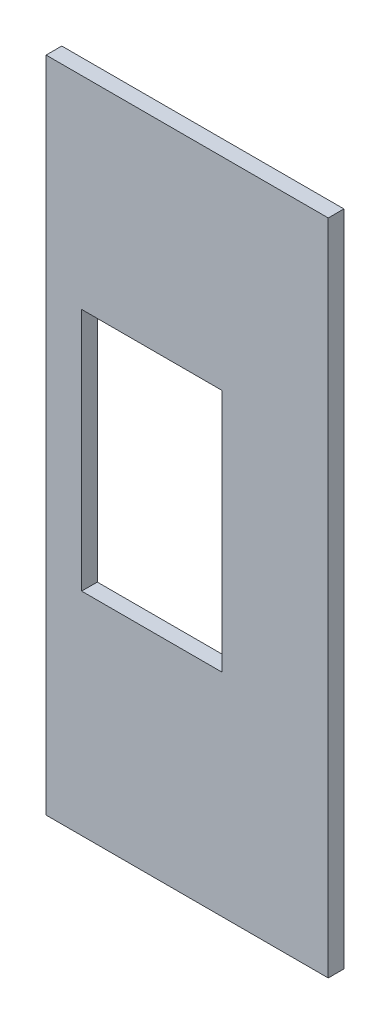
ISO-10303-21;
HEADER;
FILE_DESCRIPTION(('STEP AP214'),'2;1');
FILE_NAME('part.step','',(''),(''),'','','');
FILE_SCHEMA(('AUTOMOTIVE_DESIGN { 1 0 10303 214 1 1 1 1 }'));
ENDSEC;
DATA;
#1=APPLICATION_CONTEXT('core data for automotive mechanical design processes');
#2=APPLICATION_PROTOCOL_DEFINITION('international standard','automotive_design',2000,#1);
#3=PRODUCT_CONTEXT('',#1,'mechanical');
#4=PRODUCT('Part','Part','',(#3));
#5=PRODUCT_RELATED_PRODUCT_CATEGORY('part','',(#4));
#6=PRODUCT_DEFINITION_FORMATION('','',#4);
#7=PRODUCT_DEFINITION_CONTEXT('part definition',#1,'design');
#8=PRODUCT_DEFINITION('design','',#6,#7);
#9=PRODUCT_DEFINITION_SHAPE('','',#8);
#10=(LENGTH_UNIT() NAMED_UNIT(*) SI_UNIT(.MILLI.,.METRE.));
#11=(NAMED_UNIT(*) PLANE_ANGLE_UNIT() SI_UNIT($,.RADIAN.));
#12=(NAMED_UNIT(*) SI_UNIT($,.STERADIAN.) SOLID_ANGLE_UNIT());
#13=UNCERTAINTY_MEASURE_WITH_UNIT(LENGTH_MEASURE(1.E-05),#10,'distance_accuracy_value','');
#14=(GEOMETRIC_REPRESENTATION_CONTEXT(3) GLOBAL_UNCERTAINTY_ASSIGNED_CONTEXT((#13)) GLOBAL_UNIT_ASSIGNED_CONTEXT((#10,
#11,#12)) REPRESENTATION_CONTEXT('',''));
#15=CARTESIAN_POINT('',(0.,0.,0.));
#16=DIRECTION('',(0.,0.,1.));
#17=DIRECTION('',(1.,0.,0.));
#18=AXIS2_PLACEMENT_3D('',#15,#16,#17);
#19=CARTESIAN_POINT('',(188.065936045835,-106.020408950721,283.941063903925));
#20=DIRECTION('',(1.,0.,0.));
#21=DIRECTION('',(0.,1.,0.));
#22=AXIS2_PLACEMENT_3D('',#19,#20,#21);
#23=PLANE('',#22);
#24=DIRECTION('',(0.,-1.,0.));
#25=VECTOR('',#24,1.);
#26=CARTESIAN_POINT('',(188.065936045835,-106.020408950721,283.432971220494));
#27=LINE('',#26,#25);
#28=CARTESIAN_POINT('',(188.065936045835,-106.020408950721,283.432971220494));
#29=VERTEX_POINT('',#28);
#30=CARTESIAN_POINT('',(188.065936045835,-127.373178207628,283.432971220494));
#31=VERTEX_POINT('',#30);
#32=EDGE_CURVE('E124',#29,#31,#27,.T.);
#33=ORIENTED_EDGE('',*,*,#32,.F.);
#34=DIRECTION('',(0.,0.,-1.));
#35=VECTOR('',#34,1.);
#36=CARTESIAN_POINT('',(188.065936045835,-106.020408950721,283.941063903925));
#37=LINE('',#36,#35);
#38=CARTESIAN_POINT('',(188.065936045835,-106.020408950721,283.941063903925));
#39=VERTEX_POINT('',#38);
#40=EDGE_CURVE('E35',#39,#29,#37,.T.);
#41=ORIENTED_EDGE('',*,*,#40,.F.);
#42=DIRECTION('',(0.,-1.,0.));
#43=VECTOR('',#42,1.);
#44=CARTESIAN_POINT('',(188.065936045835,-106.020408950721,283.941063903925));
#45=LINE('',#44,#43);
#46=CARTESIAN_POINT('',(188.065936045835,-127.373178207628,283.941063903925));
#47=VERTEX_POINT('',#46);
#48=EDGE_CURVE('E103',#39,#47,#45,.T.);
#49=ORIENTED_EDGE('',*,*,#48,.T.);
#50=DIRECTION('',(0.,0.,-1.));
#51=VECTOR('',#50,1.);
#52=CARTESIAN_POINT('',(188.065936045835,-127.373178207628,283.941063903925));
#53=LINE('',#52,#51);
#54=EDGE_CURVE('E10',#47,#31,#53,.T.);
#55=ORIENTED_EDGE('',*,*,#54,.T.);
#56=EDGE_LOOP('',(#33,#41,#49,#55));
#57=FACE_BOUND('',#56,.T.);
#58=ADVANCED_FACE('F16',(#57),#23,.T.);
#59=CARTESIAN_POINT('',(188.065936045835,-127.373178207628,283.941063903925));
#60=DIRECTION('',(0.,-1.,0.));
#61=DIRECTION('',(0.,0.,-1.));
#62=AXIS2_PLACEMENT_3D('',#59,#60,#61);
#63=PLANE('',#62);
#64=DIRECTION('',(-1.,0.,0.));
#65=VECTOR('',#64,1.);
#66=CARTESIAN_POINT('',(188.065936045835,-127.373178207628,283.432971220494));
#67=LINE('',#66,#65);
#68=CARTESIAN_POINT('',(178.913166788928,-127.373178207628,283.432971220494));
#69=VERTEX_POINT('',#68);
#70=EDGE_CURVE('E127',#31,#69,#67,.T.);
#71=ORIENTED_EDGE('',*,*,#70,.F.);
#72=ORIENTED_EDGE('',*,*,#54,.F.);
#73=DIRECTION('',(-1.,0.,0.));
#74=VECTOR('',#73,1.);
#75=CARTESIAN_POINT('',(188.065936045835,-127.373178207628,283.941063903925));
#76=LINE('',#75,#74);
#77=CARTESIAN_POINT('',(178.913166788928,-127.373178207628,283.941063903925));
#78=VERTEX_POINT('',#77);
#79=EDGE_CURVE('E99',#47,#78,#76,.T.);
#80=ORIENTED_EDGE('',*,*,#79,.T.);
#81=DIRECTION('',(0.,0.,-1.));
#82=VECTOR('',#81,1.);
#83=CARTESIAN_POINT('',(178.913166788928,-127.373178207628,283.941063903925));
#84=LINE('',#83,#82);
#85=EDGE_CURVE('E26',#78,#69,#84,.T.);
#86=ORIENTED_EDGE('',*,*,#85,.T.);
#87=EDGE_LOOP('',(#71,#72,#80,#86));
#88=FACE_BOUND('',#87,.T.);
#89=ADVANCED_FACE('F100',(#88),#63,.T.);
#90=CARTESIAN_POINT('',(178.913166788928,-127.373178207628,283.941063903925));
#91=DIRECTION('',(-1.,0.,0.));
#92=DIRECTION('',(0.,0.,1.));
#93=AXIS2_PLACEMENT_3D('',#90,#91,#92);
#94=PLANE('',#93);
#95=DIRECTION('',(0.,1.,0.));
#96=VECTOR('',#95,1.);
#97=CARTESIAN_POINT('',(178.913166788928,-127.373178207628,283.432971220494));
#98=LINE('',#97,#96);
#99=CARTESIAN_POINT('',(178.913166788928,-106.020408950721,283.432971220494));
#100=VERTEX_POINT('',#99);
#101=EDGE_CURVE('E93',#69,#100,#98,.T.);
#102=ORIENTED_EDGE('',*,*,#101,.F.);
#103=ORIENTED_EDGE('',*,*,#85,.F.);
#104=DIRECTION('',(0.,1.,0.));
#105=VECTOR('',#104,1.);
#106=CARTESIAN_POINT('',(178.913166788928,-127.373178207628,283.941063903925));
#107=LINE('',#106,#105);
#108=CARTESIAN_POINT('',(178.913166788928,-106.020408950721,283.941063903925));
#109=VERTEX_POINT('',#108);
#110=EDGE_CURVE('E90',#78,#109,#107,.T.);
#111=ORIENTED_EDGE('',*,*,#110,.T.);
#112=DIRECTION('',(0.,0.,-1.));
#113=VECTOR('',#112,1.);
#114=CARTESIAN_POINT('',(178.913166788928,-106.020408950721,283.941063903925));
#115=LINE('',#114,#113);
#116=EDGE_CURVE('E63',#109,#100,#115,.T.);
#117=ORIENTED_EDGE('',*,*,#116,.T.);
#118=EDGE_LOOP('',(#102,#103,#111,#117));
#119=FACE_BOUND('',#118,.T.);
#120=ADVANCED_FACE('F88',(#119),#94,.T.);
#121=CARTESIAN_POINT('',(180.065936045835,-112.589304524067,283.941063903925));
#122=DIRECTION('',(1.,0.,0.));
#123=DIRECTION('',(0.,1.,0.));
#124=AXIS2_PLACEMENT_3D('',#121,#122,#123);
#125=PLANE('',#124);
#126=DIRECTION('',(0.,-1.,0.));
#127=VECTOR('',#126,1.);
#128=CARTESIAN_POINT('',(180.065936045835,-112.589304524067,283.432971220494));
#129=LINE('',#128,#127);
#130=CARTESIAN_POINT('',(180.065936045835,-112.589304524067,283.432971220494));
#131=VERTEX_POINT('',#130);
#132=CARTESIAN_POINT('',(180.065936045835,-120.504282634283,283.432971220494));
#133=VERTEX_POINT('',#132);
#134=EDGE_CURVE('E112',#131,#133,#129,.T.);
#135=ORIENTED_EDGE('',*,*,#134,.F.);
#136=DIRECTION('',(0.,0.,-1.));
#137=VECTOR('',#136,1.);
#138=CARTESIAN_POINT('',(180.065936045835,-112.589304524067,283.941063903925));
#139=LINE('',#138,#137);
#140=CARTESIAN_POINT('',(180.065936045835,-112.589304524067,283.941063903925));
#141=VERTEX_POINT('',#140);
#142=EDGE_CURVE('E108',#141,#131,#139,.T.);
#143=ORIENTED_EDGE('',*,*,#142,.F.);
#144=DIRECTION('',(0.,-1.,0.));
#145=VECTOR('',#144,1.);
#146=CARTESIAN_POINT('',(180.065936045835,-112.589304524067,283.941063903925));
#147=LINE('',#146,#145);
#148=CARTESIAN_POINT('',(180.065936045835,-120.504282634283,283.941063903925));
#149=VERTEX_POINT('',#148);
#150=EDGE_CURVE('E132',#141,#149,#147,.T.);
#151=ORIENTED_EDGE('',*,*,#150,.T.);
#152=DIRECTION('',(0.,0.,-1.));
#153=VECTOR('',#152,1.);
#154=CARTESIAN_POINT('',(180.065936045835,-120.504282634283,283.941063903925));
#155=LINE('',#154,#153);
#156=EDGE_CURVE('E20',#149,#133,#155,.T.);
#157=ORIENTED_EDGE('',*,*,#156,.T.);
#158=EDGE_LOOP('',(#135,#143,#151,#157));
#159=FACE_BOUND('',#158,.T.);
#160=ADVANCED_FACE('F18',(#159),#125,.T.);
#161=CARTESIAN_POINT('',(180.065936045835,-120.504282634283,283.941063903925));
#162=DIRECTION('',(0.,1.,0.));
#163=DIRECTION('',(-1.,0.,0.));
#164=AXIS2_PLACEMENT_3D('',#161,#162,#163);
#165=PLANE('',#164);
#166=DIRECTION('',(1.,0.,0.));
#167=VECTOR('',#166,1.);
#168=CARTESIAN_POINT('',(180.065936045835,-120.504282634283,283.432971220494));
#169=LINE('',#168,#167);
#170=CARTESIAN_POINT('',(184.613166788928,-120.504282634283,283.432971220494));
#171=VERTEX_POINT('',#170);
#172=EDGE_CURVE('E115',#133,#171,#169,.T.);
#173=ORIENTED_EDGE('',*,*,#172,.F.);
#174=ORIENTED_EDGE('',*,*,#156,.F.);
#175=DIRECTION('',(1.,0.,0.));
#176=VECTOR('',#175,1.);
#177=CARTESIAN_POINT('',(180.065936045835,-120.504282634283,283.941063903925));
#178=LINE('',#177,#176);
#179=CARTESIAN_POINT('',(184.613166788928,-120.504282634283,283.941063903925));
#180=VERTEX_POINT('',#179);
#181=EDGE_CURVE('E158',#149,#180,#178,.T.);
#182=ORIENTED_EDGE('',*,*,#181,.T.);
#183=DIRECTION('',(0.,0.,-1.));
#184=VECTOR('',#183,1.);
#185=CARTESIAN_POINT('',(184.613166788928,-120.504282634283,283.941063903925));
#186=LINE('',#185,#184);
#187=EDGE_CURVE('E137',#180,#171,#186,.T.);
#188=ORIENTED_EDGE('',*,*,#187,.T.);
#189=EDGE_LOOP('',(#173,#174,#182,#188));
#190=FACE_BOUND('',#189,.T.);
#191=ADVANCED_FACE('F143',(#190),#165,.T.);
#192=CARTESIAN_POINT('',(184.613166788928,-120.504282634283,283.941063903925));
#193=DIRECTION('',(-1.,0.,0.));
#194=DIRECTION('',(0.,-1.,0.));
#195=AXIS2_PLACEMENT_3D('',#192,#193,#194);
#196=PLANE('',#195);
#197=DIRECTION('',(0.,1.,0.));
#198=VECTOR('',#197,1.);
#199=CARTESIAN_POINT('',(184.613166788928,-120.504282634283,283.432971220494));
#200=LINE('',#199,#198);
#201=CARTESIAN_POINT('',(184.613166788928,-112.589304524067,283.432971220494));
#202=VERTEX_POINT('',#201);
#203=EDGE_CURVE('E118',#171,#202,#200,.T.);
#204=ORIENTED_EDGE('',*,*,#203,.F.);
#205=ORIENTED_EDGE('',*,*,#187,.F.);
#206=DIRECTION('',(0.,1.,0.));
#207=VECTOR('',#206,1.);
#208=CARTESIAN_POINT('',(184.613166788928,-120.504282634283,283.941063903925));
#209=LINE('',#208,#207);
#210=CARTESIAN_POINT('',(184.613166788928,-112.589304524067,283.941063903925));
#211=VERTEX_POINT('',#210);
#212=EDGE_CURVE('E156',#180,#211,#209,.T.);
#213=ORIENTED_EDGE('',*,*,#212,.T.);
#214=DIRECTION('',(0.,0.,-1.));
#215=VECTOR('',#214,1.);
#216=CARTESIAN_POINT('',(184.613166788928,-112.589304524067,283.941063903925));
#217=LINE('',#216,#215);
#218=EDGE_CURVE('E136',#211,#202,#217,.T.);
#219=ORIENTED_EDGE('',*,*,#218,.T.);
#220=EDGE_LOOP('',(#204,#205,#213,#219));
#221=FACE_BOUND('',#220,.T.);
#222=ADVANCED_FACE('F171',(#221),#196,.T.);
#223=CARTESIAN_POINT('',(184.613166788928,-112.589304524067,283.941063903925));
#224=DIRECTION('',(0.,-1.,0.));
#225=DIRECTION('',(1.,0.,0.));
#226=AXIS2_PLACEMENT_3D('',#223,#224,#225);
#227=PLANE('',#226);
#228=DIRECTION('',(-1.,0.,0.));
#229=VECTOR('',#228,1.);
#230=CARTESIAN_POINT('',(184.613166788928,-112.589304524067,283.432971220494));
#231=LINE('',#230,#229);
#232=EDGE_CURVE('E121',#202,#131,#231,.T.);
#233=ORIENTED_EDGE('',*,*,#232,.F.);
#234=ORIENTED_EDGE('',*,*,#218,.F.);
#235=DIRECTION('',(-1.,0.,0.));
#236=VECTOR('',#235,1.);
#237=CARTESIAN_POINT('',(184.613166788928,-112.589304524067,283.941063903925));
#238=LINE('',#237,#236);
#239=EDGE_CURVE('E153',#211,#141,#238,.T.);
#240=ORIENTED_EDGE('',*,*,#239,.T.);
#241=ORIENTED_EDGE('',*,*,#142,.T.);
#242=EDGE_LOOP('',(#233,#234,#240,#241));
#243=FACE_BOUND('',#242,.T.);
#244=ADVANCED_FACE('F149',(#243),#227,.T.);
#245=CARTESIAN_POINT('',(178.913166788928,-106.020408950721,283.941063903925));
#246=DIRECTION('',(0.,1.,0.));
#247=DIRECTION('',(0.,0.,1.));
#248=AXIS2_PLACEMENT_3D('',#245,#246,#247);
#249=PLANE('',#248);
#250=DIRECTION('',(1.,0.,0.));
#251=VECTOR('',#250,1.);
#252=CARTESIAN_POINT('',(178.913166788928,-106.020408950721,283.432971220494));
#253=LINE('',#252,#251);
#254=EDGE_CURVE('E130',#100,#29,#253,.T.);
#255=ORIENTED_EDGE('',*,*,#254,.F.);
#256=ORIENTED_EDGE('',*,*,#116,.F.);
#257=DIRECTION('',(1.,0.,0.));
#258=VECTOR('',#257,1.);
#259=CARTESIAN_POINT('',(178.913166788928,-106.020408950721,283.941063903925));
#260=LINE('',#259,#258);
#261=EDGE_CURVE('E106',#109,#39,#260,.T.);
#262=ORIENTED_EDGE('',*,*,#261,.T.);
#263=ORIENTED_EDGE('',*,*,#40,.T.);
#264=EDGE_LOOP('',(#255,#256,#262,#263));
#265=FACE_BOUND('',#264,.T.);
#266=ADVANCED_FACE('F162',(#265),#249,.T.);
#267=CARTESIAN_POINT('',(206.339551417381,-113.096793579175,283.941063903925));
#268=DIRECTION('',(0.,0.,-1.));
#269=DIRECTION('',(0.,1.,0.));
#270=AXIS2_PLACEMENT_3D('',#267,#268,#269);
#271=PLANE('',#270);
#272=ORIENTED_EDGE('',*,*,#150,.F.);
#273=ORIENTED_EDGE('',*,*,#239,.F.);
#274=ORIENTED_EDGE('',*,*,#212,.F.);
#275=ORIENTED_EDGE('',*,*,#181,.F.);
#276=EDGE_LOOP('',(#272,#273,#274,#275));
#277=FACE_BOUND('',#276,.T.);
#278=ORIENTED_EDGE('',*,*,#48,.F.);
#279=ORIENTED_EDGE('',*,*,#261,.F.);
#280=ORIENTED_EDGE('',*,*,#110,.F.);
#281=ORIENTED_EDGE('',*,*,#79,.F.);
#282=EDGE_LOOP('',(#278,#279,#280,#281));
#283=FACE_BOUND('',#282,.T.);
#284=ADVANCED_FACE('F105',(#277,#283),#271,.F.);
#285=CARTESIAN_POINT('',(206.339551417381,-113.096793579175,283.432971220494));
#286=DIRECTION('',(0.,0.,-1.));
#287=DIRECTION('',(0.,1.,0.));
#288=AXIS2_PLACEMENT_3D('',#285,#286,#287);
#289=PLANE('',#288);
#290=ORIENTED_EDGE('',*,*,#134,.T.);
#291=ORIENTED_EDGE('',*,*,#172,.T.);
#292=ORIENTED_EDGE('',*,*,#203,.T.);
#293=ORIENTED_EDGE('',*,*,#232,.T.);
#294=EDGE_LOOP('',(#290,#291,#292,#293));
#295=FACE_BOUND('',#294,.T.);
#296=ORIENTED_EDGE('',*,*,#32,.T.);
#297=ORIENTED_EDGE('',*,*,#70,.T.);
#298=ORIENTED_EDGE('',*,*,#101,.T.);
#299=ORIENTED_EDGE('',*,*,#254,.T.);
#300=EDGE_LOOP('',(#296,#297,#298,#299));
#301=FACE_BOUND('',#300,.T.);
#302=ADVANCED_FACE('F145',(#295,#301),#289,.T.);
#303=CLOSED_SHELL('',(#58,#89,#120,#160,#191,#222,#244,#266,#284,#302));
#304=MANIFOLD_SOLID_BREP('B1',#303);
#305=ADVANCED_BREP_SHAPE_REPRESENTATION('',(#18,#304),#14);
#306=SHAPE_DEFINITION_REPRESENTATION(#9,#305);
ENDSEC;
END-ISO-10303-21;
